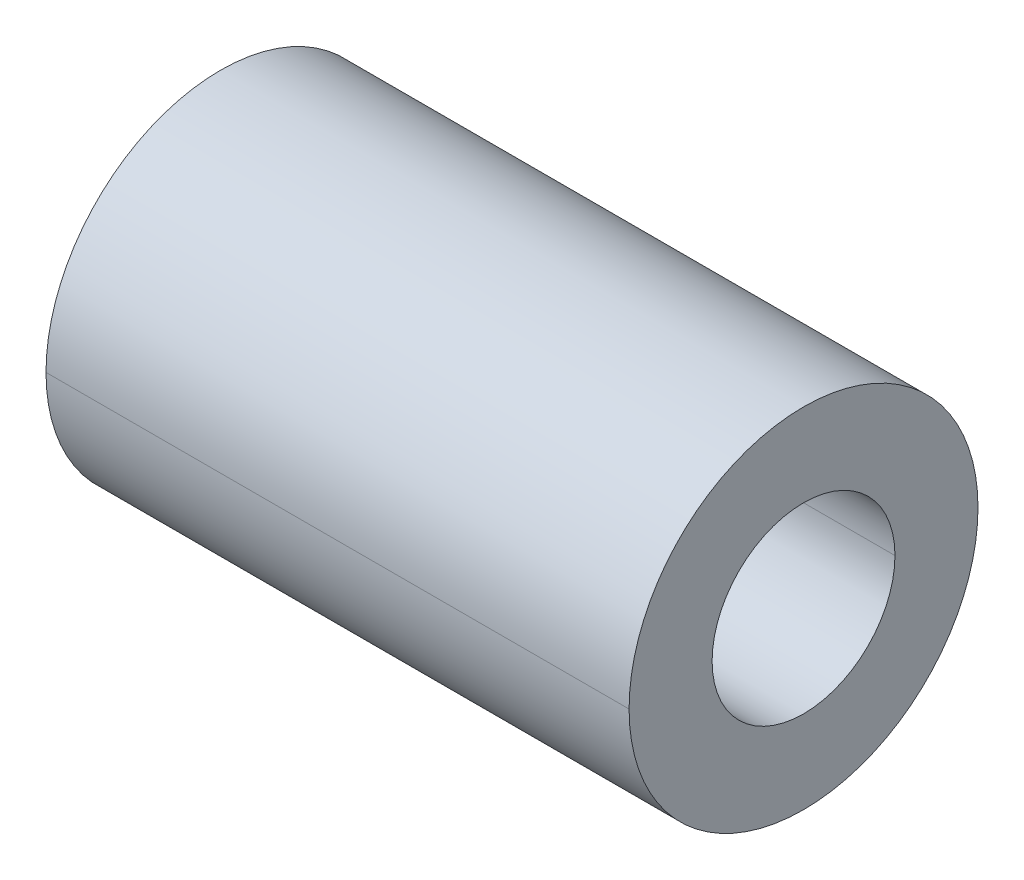
ISO-10303-21;
HEADER;
FILE_DESCRIPTION(('STEP AP214'),'2;1');
FILE_NAME('part.step','',(''),(''),'','','');
FILE_SCHEMA(('AUTOMOTIVE_DESIGN { 1 0 10303 214 1 1 1 1 }'));
ENDSEC;
DATA;
#1=APPLICATION_CONTEXT('core data for automotive mechanical design processes');
#2=APPLICATION_PROTOCOL_DEFINITION('international standard','automotive_design',2000,#1);
#3=PRODUCT_CONTEXT('',#1,'mechanical');
#4=PRODUCT('Part','Part','',(#3));
#5=PRODUCT_RELATED_PRODUCT_CATEGORY('part','',(#4));
#6=PRODUCT_DEFINITION_FORMATION('','',#4);
#7=PRODUCT_DEFINITION_CONTEXT('part definition',#1,'design');
#8=PRODUCT_DEFINITION('design','',#6,#7);
#9=PRODUCT_DEFINITION_SHAPE('','',#8);
#10=(LENGTH_UNIT() NAMED_UNIT(*) SI_UNIT(.MILLI.,.METRE.));
#11=(NAMED_UNIT(*) PLANE_ANGLE_UNIT() SI_UNIT($,.RADIAN.));
#12=(NAMED_UNIT(*) SI_UNIT($,.STERADIAN.) SOLID_ANGLE_UNIT());
#13=UNCERTAINTY_MEASURE_WITH_UNIT(LENGTH_MEASURE(1.E-05),#10,'distance_accuracy_value','');
#14=(GEOMETRIC_REPRESENTATION_CONTEXT(3) GLOBAL_UNCERTAINTY_ASSIGNED_CONTEXT((#13)) GLOBAL_UNIT_ASSIGNED_CONTEXT((#10,
#11,#12)) REPRESENTATION_CONTEXT('',''));
#15=CARTESIAN_POINT('',(0.,0.,0.));
#16=DIRECTION('',(0.,0.,1.));
#17=DIRECTION('',(1.,0.,0.));
#18=AXIS2_PLACEMENT_3D('',#15,#16,#17);
#19=CARTESIAN_POINT('',(7.9375,0.,0.));
#20=DIRECTION('',(-1.,0.,0.));
#21=DIRECTION('',(0.,0.,1.));
#22=AXIS2_PLACEMENT_3D('',#19,#20,#21);
#23=CYLINDRICAL_SURFACE('',#22,2.4892);
#24=DIRECTION('',(-1.,0.,0.));
#25=VECTOR('',#24,1.);
#26=CARTESIAN_POINT('',(7.9375,0.,-2.4892));
#27=LINE('',#26,#25);
#28=CARTESIAN_POINT('',(7.9375,0.,-2.4892));
#29=VERTEX_POINT('',#28);
#30=CARTESIAN_POINT('',(-7.9375,0.,-2.4892));
#31=VERTEX_POINT('',#30);
#32=EDGE_CURVE('E83',#29,#31,#27,.T.);
#33=ORIENTED_EDGE('',*,*,#32,.F.);
#34=CARTESIAN_POINT('',(7.9375,0.,0.));
#35=DIRECTION('',(1.,0.,0.));
#36=DIRECTION('',(0.,0.,-1.));
#37=AXIS2_PLACEMENT_3D('',#34,#35,#36);
#38=CIRCLE('',#37,2.4892);
#39=CARTESIAN_POINT('',(7.9375,0.,2.4892));
#40=VERTEX_POINT('',#39);
#41=EDGE_CURVE('E117',#29,#40,#38,.T.);
#42=ORIENTED_EDGE('',*,*,#41,.T.);
#43=DIRECTION('',(-1.,0.,0.));
#44=VECTOR('',#43,1.);
#45=CARTESIAN_POINT('',(7.9375,0.,2.4892));
#46=LINE('',#45,#44);
#47=CARTESIAN_POINT('',(-7.9375,0.,2.4892));
#48=VERTEX_POINT('',#47);
#49=EDGE_CURVE('E86',#40,#48,#46,.T.);
#50=ORIENTED_EDGE('',*,*,#49,.T.);
#51=CARTESIAN_POINT('',(-7.9375,0.,0.));
#52=DIRECTION('',(1.,0.,0.));
#53=DIRECTION('',(0.,0.,-1.));
#54=AXIS2_PLACEMENT_3D('',#51,#52,#53);
#55=CIRCLE('',#54,2.4892);
#56=EDGE_CURVE('E11',#31,#48,#55,.T.);
#57=ORIENTED_EDGE('',*,*,#56,.F.);
#58=EDGE_LOOP('',(#33,#42,#50,#57));
#59=FACE_BOUND('',#58,.T.);
#60=ADVANCED_FACE('F16',(#59),#23,.F.);
#61=CARTESIAN_POINT('',(7.9375,0.,0.));
#62=DIRECTION('',(-1.,0.,0.));
#63=DIRECTION('',(0.,0.,1.));
#64=AXIS2_PLACEMENT_3D('',#61,#62,#63);
#65=CYLINDRICAL_SURFACE('',#64,4.7498);
#66=DIRECTION('',(-1.,0.,0.));
#67=VECTOR('',#66,1.);
#68=CARTESIAN_POINT('',(7.9375,0.,-4.7498));
#69=LINE('',#68,#67);
#70=CARTESIAN_POINT('',(7.9375,0.,-4.7498));
#71=VERTEX_POINT('',#70);
#72=CARTESIAN_POINT('',(-7.9375,0.,-4.7498));
#73=VERTEX_POINT('',#72);
#74=EDGE_CURVE('E106',#71,#73,#69,.T.);
#75=ORIENTED_EDGE('',*,*,#74,.F.);
#76=CARTESIAN_POINT('',(7.9375,0.,0.));
#77=DIRECTION('',(1.,0.,0.));
#78=DIRECTION('',(0.,0.,-1.));
#79=AXIS2_PLACEMENT_3D('',#76,#77,#78);
#80=CIRCLE('',#79,4.7498);
#81=CARTESIAN_POINT('',(7.9375,0.,4.7498));
#82=VERTEX_POINT('',#81);
#83=EDGE_CURVE('E62',#82,#71,#80,.T.);
#84=ORIENTED_EDGE('',*,*,#83,.F.);
#85=DIRECTION('',(-1.,0.,0.));
#86=VECTOR('',#85,1.);
#87=CARTESIAN_POINT('',(7.9375,0.,4.7498));
#88=LINE('',#87,#86);
#89=CARTESIAN_POINT('',(-7.9375,0.,4.7498));
#90=VERTEX_POINT('',#89);
#91=EDGE_CURVE('E113',#82,#90,#88,.T.);
#92=ORIENTED_EDGE('',*,*,#91,.T.);
#93=CARTESIAN_POINT('',(-7.9375,0.,0.));
#94=DIRECTION('',(1.,0.,0.));
#95=DIRECTION('',(0.,0.,-1.));
#96=AXIS2_PLACEMENT_3D('',#93,#94,#95);
#97=CIRCLE('',#96,4.7498);
#98=EDGE_CURVE('E20',#90,#73,#97,.T.);
#99=ORIENTED_EDGE('',*,*,#98,.T.);
#100=EDGE_LOOP('',(#75,#84,#92,#99));
#101=FACE_BOUND('',#100,.T.);
#102=ADVANCED_FACE('F124',(#101),#65,.T.);
#103=CARTESIAN_POINT('',(-7.9375,0.,0.));
#104=DIRECTION('',(1.,0.,0.));
#105=DIRECTION('',(0.,1.,0.));
#106=AXIS2_PLACEMENT_3D('',#103,#104,#105);
#107=PLANE('',#106);
#108=CARTESIAN_POINT('',(-7.9375,0.,0.));
#109=DIRECTION('',(1.,0.,0.));
#110=DIRECTION('',(0.,0.,-1.));
#111=AXIS2_PLACEMENT_3D('',#108,#109,#110);
#112=CIRCLE('',#111,2.4892);
#113=EDGE_CURVE('E88',#48,#31,#112,.T.);
#114=ORIENTED_EDGE('',*,*,#113,.T.);
#115=ORIENTED_EDGE('',*,*,#56,.T.);
#116=EDGE_LOOP('',(#114,#115));
#117=FACE_BOUND('',#116,.T.);
#118=ORIENTED_EDGE('',*,*,#98,.F.);
#119=CARTESIAN_POINT('',(-7.9375,0.,0.));
#120=DIRECTION('',(1.,0.,0.));
#121=DIRECTION('',(0.,0.,-1.));
#122=AXIS2_PLACEMENT_3D('',#119,#120,#121);
#123=CIRCLE('',#122,4.7498);
#124=EDGE_CURVE('E110',#73,#90,#123,.T.);
#125=ORIENTED_EDGE('',*,*,#124,.F.);
#126=EDGE_LOOP('',(#118,#125));
#127=FACE_BOUND('',#126,.T.);
#128=ADVANCED_FACE('F89',(#117,#127),#107,.F.);
#129=CARTESIAN_POINT('',(7.9375,0.,0.));
#130=DIRECTION('',(1.,0.,0.));
#131=DIRECTION('',(0.,1.,0.));
#132=AXIS2_PLACEMENT_3D('',#129,#130,#131);
#133=PLANE('',#132);
#134=CARTESIAN_POINT('',(7.9375,0.,0.));
#135=DIRECTION('',(1.,0.,0.));
#136=DIRECTION('',(0.,0.,-1.));
#137=AXIS2_PLACEMENT_3D('',#134,#135,#136);
#138=CIRCLE('',#137,2.4892);
#139=EDGE_CURVE('E94',#40,#29,#138,.T.);
#140=ORIENTED_EDGE('',*,*,#139,.F.);
#141=ORIENTED_EDGE('',*,*,#41,.F.);
#142=EDGE_LOOP('',(#140,#141));
#143=FACE_BOUND('',#142,.T.);
#144=ORIENTED_EDGE('',*,*,#83,.T.);
#145=CARTESIAN_POINT('',(7.9375,0.,0.));
#146=DIRECTION('',(1.,0.,0.));
#147=DIRECTION('',(0.,0.,-1.));
#148=AXIS2_PLACEMENT_3D('',#145,#146,#147);
#149=CIRCLE('',#148,4.7498);
#150=EDGE_CURVE('E104',#71,#82,#149,.T.);
#151=ORIENTED_EDGE('',*,*,#150,.T.);
#152=EDGE_LOOP('',(#144,#151));
#153=FACE_BOUND('',#152,.T.);
#154=ADVANCED_FACE('F172',(#143,#153),#133,.T.);
#155=CARTESIAN_POINT('',(7.9375,0.,0.));
#156=DIRECTION('',(-1.,0.,0.));
#157=DIRECTION('',(0.,0.,1.));
#158=AXIS2_PLACEMENT_3D('',#155,#156,#157);
#159=CYLINDRICAL_SURFACE('',#158,4.7498);
#160=ORIENTED_EDGE('',*,*,#150,.F.);
#161=ORIENTED_EDGE('',*,*,#74,.T.);
#162=ORIENTED_EDGE('',*,*,#124,.T.);
#163=ORIENTED_EDGE('',*,*,#91,.F.);
#164=EDGE_LOOP('',(#160,#161,#162,#163));
#165=FACE_BOUND('',#164,.T.);
#166=ADVANCED_FACE('F129',(#165),#159,.T.);
#167=CARTESIAN_POINT('',(7.9375,0.,0.));
#168=DIRECTION('',(-1.,0.,0.));
#169=DIRECTION('',(0.,0.,1.));
#170=AXIS2_PLACEMENT_3D('',#167,#168,#169);
#171=CYLINDRICAL_SURFACE('',#170,2.4892);
#172=ORIENTED_EDGE('',*,*,#139,.T.);
#173=ORIENTED_EDGE('',*,*,#32,.T.);
#174=ORIENTED_EDGE('',*,*,#113,.F.);
#175=ORIENTED_EDGE('',*,*,#49,.F.);
#176=EDGE_LOOP('',(#172,#173,#174,#175));
#177=FACE_BOUND('',#176,.T.);
#178=ADVANCED_FACE('F18',(#177),#171,.F.);
#179=CLOSED_SHELL('',(#60,#102,#128,#154,#166,#178));
#180=MANIFOLD_SOLID_BREP('B1',#179);
#181=ADVANCED_BREP_SHAPE_REPRESENTATION('',(#18,#180),#14);
#182=SHAPE_DEFINITION_REPRESENTATION(#9,#181);
ENDSEC;
END-ISO-10303-21;
